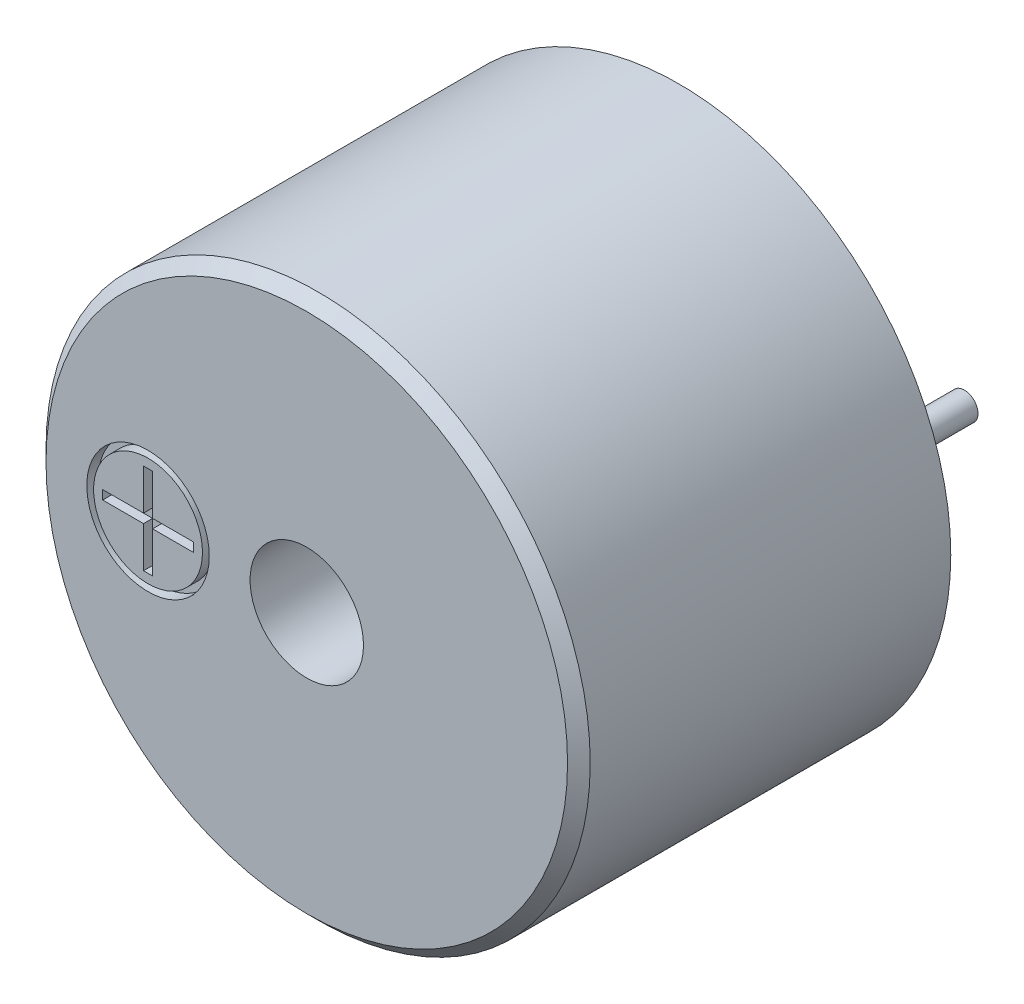
ISO-10303-21;
HEADER;
FILE_DESCRIPTION(('STEP AP214'),'2;1');
FILE_NAME('part.step','',(''),(''),'','','');
FILE_SCHEMA(('AUTOMOTIVE_DESIGN { 1 0 10303 214 1 1 1 1 }'));
ENDSEC;
DATA;
#1=APPLICATION_CONTEXT('core data for automotive mechanical design processes');
#2=APPLICATION_PROTOCOL_DEFINITION('international standard','automotive_design',2000,#1);
#3=PRODUCT_CONTEXT('',#1,'mechanical');
#4=PRODUCT('Part','Part','',(#3));
#5=PRODUCT_RELATED_PRODUCT_CATEGORY('part','',(#4));
#6=PRODUCT_DEFINITION_FORMATION('','',#4);
#7=PRODUCT_DEFINITION_CONTEXT('part definition',#1,'design');
#8=PRODUCT_DEFINITION('design','',#6,#7);
#9=PRODUCT_DEFINITION_SHAPE('','',#8);
#10=(LENGTH_UNIT() NAMED_UNIT(*) SI_UNIT(.MILLI.,.METRE.));
#11=(NAMED_UNIT(*) PLANE_ANGLE_UNIT() SI_UNIT($,.RADIAN.));
#12=(NAMED_UNIT(*) SI_UNIT($,.STERADIAN.) SOLID_ANGLE_UNIT());
#13=UNCERTAINTY_MEASURE_WITH_UNIT(LENGTH_MEASURE(1.E-05),#10,'distance_accuracy_value','');
#14=(GEOMETRIC_REPRESENTATION_CONTEXT(3) GLOBAL_UNCERTAINTY_ASSIGNED_CONTEXT((#13)) GLOBAL_UNIT_ASSIGNED_CONTEXT((#10,
#11,#12)) REPRESENTATION_CONTEXT('',''));
#15=CARTESIAN_POINT('',(0.,0.,0.));
#16=DIRECTION('',(0.,0.,1.));
#17=DIRECTION('',(1.,0.,0.));
#18=AXIS2_PLACEMENT_3D('',#15,#16,#17);
#19=CARTESIAN_POINT('',(-1.2,-0.1,8.));
#20=DIRECTION('',(0.,0.,1.));
#21=DIRECTION('',(1.,0.,0.));
#22=AXIS2_PLACEMENT_3D('',#19,#20,#21);
#23=PLANE('',#22);
#24=DIRECTION('',(1.,0.,0.));
#25=VECTOR('',#24,1.);
#26=CARTESIAN_POINT('',(-1.2,0.1,8.));
#27=LINE('',#26,#25);
#28=CARTESIAN_POINT('',(-0.3,0.1,8.));
#29=VERTEX_POINT('',#28);
#30=CARTESIAN_POINT('',(-0.1,0.1,8.));
#31=VERTEX_POINT('',#30);
#32=EDGE_CURVE('E11',#29,#31,#27,.T.);
#33=ORIENTED_EDGE('',*,*,#32,.F.);
#34=DIRECTION('',(0.,1.,0.));
#35=VECTOR('',#34,1.);
#36=CARTESIAN_POINT('',(-0.3,-1.,8.));
#37=LINE('',#36,#35);
#38=CARTESIAN_POINT('',(-0.3,-0.1,8.));
#39=VERTEX_POINT('',#38);
#40=EDGE_CURVE('E268',#39,#29,#37,.T.);
#41=ORIENTED_EDGE('',*,*,#40,.F.);
#42=DIRECTION('',(1.,0.,0.));
#43=VECTOR('',#42,1.);
#44=CARTESIAN_POINT('',(-1.2,-0.1,8.));
#45=LINE('',#44,#43);
#46=CARTESIAN_POINT('',(-0.1,-0.1,8.));
#47=VERTEX_POINT('',#46);
#48=EDGE_CURVE('E271',#39,#47,#45,.T.);
#49=ORIENTED_EDGE('',*,*,#48,.T.);
#50=DIRECTION('',(0.,1.,0.));
#51=VECTOR('',#50,1.);
#52=CARTESIAN_POINT('',(-0.1,-1.,8.));
#53=LINE('',#52,#51);
#54=EDGE_CURVE('E27',#47,#31,#53,.T.);
#55=ORIENTED_EDGE('',*,*,#54,.T.);
#56=EDGE_LOOP('',(#33,#41,#49,#55));
#57=FACE_BOUND('',#56,.T.);
#58=ADVANCED_FACE('F16',(#57),#23,.T.);
#59=CARTESIAN_POINT('',(-0.1,-1.,8.));
#60=DIRECTION('',(0.,0.,1.));
#61=DIRECTION('',(1.,0.,0.));
#62=AXIS2_PLACEMENT_3D('',#59,#60,#61);
#63=PLANE('',#62);
#64=DIRECTION('',(0.,1.,0.));
#65=VECTOR('',#64,1.);
#66=CARTESIAN_POINT('',(-0.3,-1.,8.));
#67=LINE('',#66,#65);
#68=CARTESIAN_POINT('',(-0.3,1.,8.));
#69=VERTEX_POINT('',#68);
#70=EDGE_CURVE('E344',#29,#69,#67,.T.);
#71=ORIENTED_EDGE('',*,*,#70,.F.);
#72=ORIENTED_EDGE('',*,*,#32,.T.);
#73=DIRECTION('',(0.,1.,0.));
#74=VECTOR('',#73,1.);
#75=CARTESIAN_POINT('',(-0.1,-1.,8.));
#76=LINE('',#75,#74);
#77=CARTESIAN_POINT('',(-0.1,1.,8.));
#78=VERTEX_POINT('',#77);
#79=EDGE_CURVE('E213',#31,#78,#76,.T.);
#80=ORIENTED_EDGE('',*,*,#79,.T.);
#81=DIRECTION('',(-1.,0.,0.));
#82=VECTOR('',#81,1.);
#83=CARTESIAN_POINT('',(-0.1,1.,8.));
#84=LINE('',#83,#82);
#85=EDGE_CURVE('E257',#78,#69,#84,.T.);
#86=ORIENTED_EDGE('',*,*,#85,.T.);
#87=EDGE_LOOP('',(#71,#72,#80,#86));
#88=FACE_BOUND('',#87,.T.);
#89=ADVANCED_FACE('F406',(#88),#63,.T.);
#90=CARTESIAN_POINT('',(-1.2,-0.1,8.));
#91=DIRECTION('',(0.,0.,1.));
#92=DIRECTION('',(1.,0.,0.));
#93=AXIS2_PLACEMENT_3D('',#90,#91,#92);
#94=PLANE('',#93);
#95=DIRECTION('',(1.,0.,0.));
#96=VECTOR('',#95,1.);
#97=CARTESIAN_POINT('',(-1.2,0.1,8.));
#98=LINE('',#97,#96);
#99=CARTESIAN_POINT('',(0.8,0.1,8.));
#100=VERTEX_POINT('',#99);
#101=EDGE_CURVE('E210',#31,#100,#98,.T.);
#102=ORIENTED_EDGE('',*,*,#101,.F.);
#103=ORIENTED_EDGE('',*,*,#54,.F.);
#104=DIRECTION('',(1.,0.,0.));
#105=VECTOR('',#104,1.);
#106=CARTESIAN_POINT('',(-1.2,-0.1,8.));
#107=LINE('',#106,#105);
#108=CARTESIAN_POINT('',(0.8,-0.1,8.));
#109=VERTEX_POINT('',#108);
#110=EDGE_CURVE('E337',#47,#109,#107,.T.);
#111=ORIENTED_EDGE('',*,*,#110,.T.);
#112=DIRECTION('',(0.,1.,0.));
#113=VECTOR('',#112,1.);
#114=CARTESIAN_POINT('',(0.8,-0.1,8.));
#115=LINE('',#114,#113);
#116=EDGE_CURVE('E263',#109,#100,#115,.T.);
#117=ORIENTED_EDGE('',*,*,#116,.T.);
#118=EDGE_LOOP('',(#102,#103,#111,#117));
#119=FACE_BOUND('',#118,.T.);
#120=ADVANCED_FACE('F675',(#119),#94,.T.);
#121=CARTESIAN_POINT('',(-0.1,-1.,8.));
#122=DIRECTION('',(0.,0.,1.));
#123=DIRECTION('',(1.,0.,0.));
#124=AXIS2_PLACEMENT_3D('',#121,#122,#123);
#125=PLANE('',#124);
#126=DIRECTION('',(0.,1.,0.));
#127=VECTOR('',#126,1.);
#128=CARTESIAN_POINT('',(-0.3,-1.,8.));
#129=LINE('',#128,#127);
#130=CARTESIAN_POINT('',(-0.3,-1.,8.));
#131=VERTEX_POINT('',#130);
#132=EDGE_CURVE('E227',#131,#39,#129,.T.);
#133=ORIENTED_EDGE('',*,*,#132,.F.);
#134=DIRECTION('',(-1.,0.,0.));
#135=VECTOR('',#134,1.);
#136=CARTESIAN_POINT('',(-0.1,-1.,8.));
#137=LINE('',#136,#135);
#138=CARTESIAN_POINT('',(-0.1,-1.,8.));
#139=VERTEX_POINT('',#138);
#140=EDGE_CURVE('E349',#139,#131,#137,.T.);
#141=ORIENTED_EDGE('',*,*,#140,.F.);
#142=DIRECTION('',(0.,1.,0.));
#143=VECTOR('',#142,1.);
#144=CARTESIAN_POINT('',(-0.1,-1.,8.));
#145=LINE('',#144,#143);
#146=EDGE_CURVE('E20',#139,#47,#145,.T.);
#147=ORIENTED_EDGE('',*,*,#146,.T.);
#148=ORIENTED_EDGE('',*,*,#48,.F.);
#149=EDGE_LOOP('',(#133,#141,#147,#148));
#150=FACE_BOUND('',#149,.T.);
#151=ADVANCED_FACE('F448',(#150),#125,.T.);
#152=CARTESIAN_POINT('',(-1.2,-0.1,8.));
#153=DIRECTION('',(0.,0.,1.));
#154=DIRECTION('',(1.,0.,0.));
#155=AXIS2_PLACEMENT_3D('',#152,#153,#154);
#156=PLANE('',#155);
#157=DIRECTION('',(1.,0.,0.));
#158=VECTOR('',#157,1.);
#159=CARTESIAN_POINT('',(-1.2,0.1,8.));
#160=LINE('',#159,#158);
#161=CARTESIAN_POINT('',(-1.2,0.1,8.));
#162=VERTEX_POINT('',#161);
#163=EDGE_CURVE('E272',#162,#29,#160,.T.);
#164=ORIENTED_EDGE('',*,*,#163,.F.);
#165=DIRECTION('',(0.,1.,0.));
#166=VECTOR('',#165,1.);
#167=CARTESIAN_POINT('',(-1.2,-0.1,8.));
#168=LINE('',#167,#166);
#169=CARTESIAN_POINT('',(-1.2,-0.1,8.));
#170=VERTEX_POINT('',#169);
#171=EDGE_CURVE('E251',#170,#162,#168,.T.);
#172=ORIENTED_EDGE('',*,*,#171,.F.);
#173=DIRECTION('',(1.,0.,0.));
#174=VECTOR('',#173,1.);
#175=CARTESIAN_POINT('',(-1.2,-0.1,8.));
#176=LINE('',#175,#174);
#177=EDGE_CURVE('E285',#170,#39,#176,.T.);
#178=ORIENTED_EDGE('',*,*,#177,.T.);
#179=ORIENTED_EDGE('',*,*,#40,.T.);
#180=EDGE_LOOP('',(#164,#172,#178,#179));
#181=FACE_BOUND('',#180,.T.);
#182=ADVANCED_FACE('F425',(#181),#156,.T.);
#183=CARTESIAN_POINT('',(-1.2,0.1,8.));
#184=DIRECTION('',(0.,1.,0.));
#185=DIRECTION('',(1.,0.,0.));
#186=AXIS2_PLACEMENT_3D('',#183,#184,#185);
#187=PLANE('',#186);
#188=DIRECTION('',(0.,0.,1.));
#189=VECTOR('',#188,1.);
#190=CARTESIAN_POINT('',(-0.3,0.1,8.));
#191=LINE('',#190,#189);
#192=CARTESIAN_POINT('',(-0.3,0.1,8.2));
#193=VERTEX_POINT('',#192);
#194=EDGE_CURVE('E261',#29,#193,#191,.T.);
#195=ORIENTED_EDGE('',*,*,#194,.T.);
#196=DIRECTION('',(1.,0.,0.));
#197=VECTOR('',#196,1.);
#198=CARTESIAN_POINT('',(-1.2,0.1,8.2));
#199=LINE('',#198,#197);
#200=CARTESIAN_POINT('',(-1.2,0.1,8.2));
#201=VERTEX_POINT('',#200);
#202=EDGE_CURVE('E312',#201,#193,#199,.T.);
#203=ORIENTED_EDGE('',*,*,#202,.F.);
#204=DIRECTION('',(0.,0.,1.));
#205=VECTOR('',#204,1.);
#206=CARTESIAN_POINT('',(-1.2,0.1,8.));
#207=LINE('',#206,#205);
#208=EDGE_CURVE('E255',#162,#201,#207,.T.);
#209=ORIENTED_EDGE('',*,*,#208,.F.);
#210=ORIENTED_EDGE('',*,*,#163,.T.);
#211=EDGE_LOOP('',(#195,#203,#209,#210));
#212=FACE_BOUND('',#211,.T.);
#213=ADVANCED_FACE('F421',(#212),#187,.F.);
#214=CARTESIAN_POINT('',(-0.3,-1.,8.));
#215=DIRECTION('',(-1.,0.,0.));
#216=DIRECTION('',(0.,1.,0.));
#217=AXIS2_PLACEMENT_3D('',#214,#215,#216);
#218=PLANE('',#217);
#219=DIRECTION('',(0.,0.,1.));
#220=VECTOR('',#219,1.);
#221=CARTESIAN_POINT('',(-0.3,1.,8.));
#222=LINE('',#221,#220);
#223=CARTESIAN_POINT('',(-0.3,1.,8.2));
#224=VERTEX_POINT('',#223);
#225=EDGE_CURVE('E262',#69,#224,#222,.T.);
#226=ORIENTED_EDGE('',*,*,#225,.T.);
#227=DIRECTION('',(0.,1.,0.));
#228=VECTOR('',#227,1.);
#229=CARTESIAN_POINT('',(-0.3,-1.,8.2));
#230=LINE('',#229,#228);
#231=EDGE_CURVE('E325',#193,#224,#230,.T.);
#232=ORIENTED_EDGE('',*,*,#231,.F.);
#233=ORIENTED_EDGE('',*,*,#194,.F.);
#234=ORIENTED_EDGE('',*,*,#70,.T.);
#235=EDGE_LOOP('',(#226,#232,#233,#234));
#236=FACE_BOUND('',#235,.T.);
#237=ADVANCED_FACE('F402',(#236),#218,.F.);
#238=CARTESIAN_POINT('',(-0.1,1.,8.));
#239=DIRECTION('',(0.,1.,0.));
#240=DIRECTION('',(1.,0.,0.));
#241=AXIS2_PLACEMENT_3D('',#238,#239,#240);
#242=PLANE('',#241);
#243=DIRECTION('',(-1.,0.,0.));
#244=VECTOR('',#243,1.);
#245=CARTESIAN_POINT('',(-0.1,1.,8.2));
#246=LINE('',#245,#244);
#247=CARTESIAN_POINT('',(-0.1,1.,8.2));
#248=VERTEX_POINT('',#247);
#249=EDGE_CURVE('E299',#248,#224,#246,.T.);
#250=ORIENTED_EDGE('',*,*,#249,.T.);
#251=ORIENTED_EDGE('',*,*,#225,.F.);
#252=ORIENTED_EDGE('',*,*,#85,.F.);
#253=DIRECTION('',(0.,0.,1.));
#254=VECTOR('',#253,1.);
#255=CARTESIAN_POINT('',(-0.1,1.,8.));
#256=LINE('',#255,#254);
#257=EDGE_CURVE('E279',#78,#248,#256,.T.);
#258=ORIENTED_EDGE('',*,*,#257,.T.);
#259=EDGE_LOOP('',(#250,#251,#252,#258));
#260=FACE_BOUND('',#259,.T.);
#261=ADVANCED_FACE('F410',(#260),#242,.F.);
#262=CARTESIAN_POINT('',(-0.1,-1.,8.));
#263=DIRECTION('',(-1.,0.,0.));
#264=DIRECTION('',(0.,1.,0.));
#265=AXIS2_PLACEMENT_3D('',#262,#263,#264);
#266=PLANE('',#265);
#267=ORIENTED_EDGE('',*,*,#79,.F.);
#268=DIRECTION('',(0.,0.,1.));
#269=VECTOR('',#268,1.);
#270=CARTESIAN_POINT('',(-0.1,0.1,8.));
#271=LINE('',#270,#269);
#272=CARTESIAN_POINT('',(-0.1,0.1,8.2));
#273=VERTEX_POINT('',#272);
#274=EDGE_CURVE('E214',#31,#273,#271,.T.);
#275=ORIENTED_EDGE('',*,*,#274,.T.);
#276=DIRECTION('',(0.,1.,0.));
#277=VECTOR('',#276,1.);
#278=CARTESIAN_POINT('',(-0.1,-1.,8.2));
#279=LINE('',#278,#277);
#280=EDGE_CURVE('E243',#273,#248,#279,.T.);
#281=ORIENTED_EDGE('',*,*,#280,.T.);
#282=ORIENTED_EDGE('',*,*,#257,.F.);
#283=EDGE_LOOP('',(#267,#275,#281,#282));
#284=FACE_BOUND('',#283,.T.);
#285=ADVANCED_FACE('F643',(#284),#266,.T.);
#286=CARTESIAN_POINT('',(-1.2,0.1,8.));
#287=DIRECTION('',(0.,1.,0.));
#288=DIRECTION('',(1.,0.,0.));
#289=AXIS2_PLACEMENT_3D('',#286,#287,#288);
#290=PLANE('',#289);
#291=DIRECTION('',(0.,0.,1.));
#292=VECTOR('',#291,1.);
#293=CARTESIAN_POINT('',(0.8,0.1,8.));
#294=LINE('',#293,#292);
#295=CARTESIAN_POINT('',(0.8,0.1,8.2));
#296=VERTEX_POINT('',#295);
#297=EDGE_CURVE('E267',#100,#296,#294,.T.);
#298=ORIENTED_EDGE('',*,*,#297,.T.);
#299=DIRECTION('',(1.,0.,0.));
#300=VECTOR('',#299,1.);
#301=CARTESIAN_POINT('',(-1.2,0.1,8.2));
#302=LINE('',#301,#300);
#303=EDGE_CURVE('E238',#273,#296,#302,.T.);
#304=ORIENTED_EDGE('',*,*,#303,.F.);
#305=ORIENTED_EDGE('',*,*,#274,.F.);
#306=ORIENTED_EDGE('',*,*,#101,.T.);
#307=EDGE_LOOP('',(#298,#304,#305,#306));
#308=FACE_BOUND('',#307,.T.);
#309=ADVANCED_FACE('F647',(#308),#290,.F.);
#310=CARTESIAN_POINT('',(0.8,-0.1,8.));
#311=DIRECTION('',(1.,0.,0.));
#312=DIRECTION('',(0.,1.,0.));
#313=AXIS2_PLACEMENT_3D('',#310,#311,#312);
#314=PLANE('',#313);
#315=DIRECTION('',(0.,1.,0.));
#316=VECTOR('',#315,1.);
#317=CARTESIAN_POINT('',(0.8,-0.1,8.2));
#318=LINE('',#317,#316);
#319=CARTESIAN_POINT('',(0.8,-0.1,8.2));
#320=VERTEX_POINT('',#319);
#321=EDGE_CURVE('E242',#320,#296,#318,.T.);
#322=ORIENTED_EDGE('',*,*,#321,.T.);
#323=ORIENTED_EDGE('',*,*,#297,.F.);
#324=ORIENTED_EDGE('',*,*,#116,.F.);
#325=DIRECTION('',(0.,0.,1.));
#326=VECTOR('',#325,1.);
#327=CARTESIAN_POINT('',(0.8,-0.1,8.));
#328=LINE('',#327,#326);
#329=EDGE_CURVE('E335',#109,#320,#328,.T.);
#330=ORIENTED_EDGE('',*,*,#329,.T.);
#331=EDGE_LOOP('',(#322,#323,#324,#330));
#332=FACE_BOUND('',#331,.T.);
#333=ADVANCED_FACE('F805',(#332),#314,.F.);
#334=CARTESIAN_POINT('',(-1.2,-0.1,8.));
#335=DIRECTION('',(0.,1.,0.));
#336=DIRECTION('',(1.,0.,0.));
#337=AXIS2_PLACEMENT_3D('',#334,#335,#336);
#338=PLANE('',#337);
#339=ORIENTED_EDGE('',*,*,#110,.F.);
#340=DIRECTION('',(0.,0.,1.));
#341=VECTOR('',#340,1.);
#342=CARTESIAN_POINT('',(-0.1,-0.1,8.));
#343=LINE('',#342,#341);
#344=CARTESIAN_POINT('',(-0.1,-0.1,8.2));
#345=VERTEX_POINT('',#344);
#346=EDGE_CURVE('E394',#47,#345,#343,.T.);
#347=ORIENTED_EDGE('',*,*,#346,.T.);
#348=DIRECTION('',(1.,0.,0.));
#349=VECTOR('',#348,1.);
#350=CARTESIAN_POINT('',(-1.2,-0.1,8.2));
#351=LINE('',#350,#349);
#352=EDGE_CURVE('E292',#345,#320,#351,.T.);
#353=ORIENTED_EDGE('',*,*,#352,.T.);
#354=ORIENTED_EDGE('',*,*,#329,.F.);
#355=EDGE_LOOP('',(#339,#347,#353,#354));
#356=FACE_BOUND('',#355,.T.);
#357=ADVANCED_FACE('F657',(#356),#338,.T.);
#358=CARTESIAN_POINT('',(-0.1,-1.,8.));
#359=DIRECTION('',(-1.,0.,0.));
#360=DIRECTION('',(0.,1.,0.));
#361=AXIS2_PLACEMENT_3D('',#358,#359,#360);
#362=PLANE('',#361);
#363=ORIENTED_EDGE('',*,*,#146,.F.);
#364=DIRECTION('',(0.,0.,1.));
#365=VECTOR('',#364,1.);
#366=CARTESIAN_POINT('',(-0.1,-1.,8.));
#367=LINE('',#366,#365);
#368=CARTESIAN_POINT('',(-0.1,-1.,8.2));
#369=VERTEX_POINT('',#368);
#370=EDGE_CURVE('E324',#139,#369,#367,.T.);
#371=ORIENTED_EDGE('',*,*,#370,.T.);
#372=DIRECTION('',(0.,1.,0.));
#373=VECTOR('',#372,1.);
#374=CARTESIAN_POINT('',(-0.1,-1.,8.2));
#375=LINE('',#374,#373);
#376=EDGE_CURVE('E234',#369,#345,#375,.T.);
#377=ORIENTED_EDGE('',*,*,#376,.T.);
#378=ORIENTED_EDGE('',*,*,#346,.F.);
#379=EDGE_LOOP('',(#363,#371,#377,#378));
#380=FACE_BOUND('',#379,.T.);
#381=ADVANCED_FACE('F653',(#380),#362,.T.);
#382=CARTESIAN_POINT('',(-0.1,-1.,8.));
#383=DIRECTION('',(0.,1.,0.));
#384=DIRECTION('',(1.,0.,0.));
#385=AXIS2_PLACEMENT_3D('',#382,#383,#384);
#386=PLANE('',#385);
#387=ORIENTED_EDGE('',*,*,#370,.F.);
#388=ORIENTED_EDGE('',*,*,#140,.T.);
#389=DIRECTION('',(0.,0.,1.));
#390=VECTOR('',#389,1.);
#391=CARTESIAN_POINT('',(-0.3,-1.,8.));
#392=LINE('',#391,#390);
#393=CARTESIAN_POINT('',(-0.3,-1.,8.2));
#394=VERTEX_POINT('',#393);
#395=EDGE_CURVE('E224',#131,#394,#392,.T.);
#396=ORIENTED_EDGE('',*,*,#395,.T.);
#397=DIRECTION('',(-1.,0.,0.));
#398=VECTOR('',#397,1.);
#399=CARTESIAN_POINT('',(-0.1,-1.,8.2));
#400=LINE('',#399,#398);
#401=EDGE_CURVE('E229',#369,#394,#400,.T.);
#402=ORIENTED_EDGE('',*,*,#401,.F.);
#403=EDGE_LOOP('',(#387,#388,#396,#402));
#404=FACE_BOUND('',#403,.T.);
#405=ADVANCED_FACE('F446',(#404),#386,.T.);
#406=CARTESIAN_POINT('',(-0.3,-1.,8.));
#407=DIRECTION('',(-1.,0.,0.));
#408=DIRECTION('',(0.,1.,0.));
#409=AXIS2_PLACEMENT_3D('',#406,#407,#408);
#410=PLANE('',#409);
#411=DIRECTION('',(0.,0.,1.));
#412=VECTOR('',#411,1.);
#413=CARTESIAN_POINT('',(-0.3,-0.1,8.));
#414=LINE('',#413,#412);
#415=CARTESIAN_POINT('',(-0.3,-0.1,8.2));
#416=VERTEX_POINT('',#415);
#417=EDGE_CURVE('E228',#39,#416,#414,.T.);
#418=ORIENTED_EDGE('',*,*,#417,.T.);
#419=DIRECTION('',(0.,1.,0.));
#420=VECTOR('',#419,1.);
#421=CARTESIAN_POINT('',(-0.3,-1.,8.2));
#422=LINE('',#421,#420);
#423=EDGE_CURVE('E233',#394,#416,#422,.T.);
#424=ORIENTED_EDGE('',*,*,#423,.F.);
#425=ORIENTED_EDGE('',*,*,#395,.F.);
#426=ORIENTED_EDGE('',*,*,#132,.T.);
#427=EDGE_LOOP('',(#418,#424,#425,#426));
#428=FACE_BOUND('',#427,.T.);
#429=ADVANCED_FACE('F435',(#428),#410,.F.);
#430=CARTESIAN_POINT('',(-1.2,-0.1,8.));
#431=DIRECTION('',(0.,1.,0.));
#432=DIRECTION('',(1.,0.,0.));
#433=AXIS2_PLACEMENT_3D('',#430,#431,#432);
#434=PLANE('',#433);
#435=ORIENTED_EDGE('',*,*,#177,.F.);
#436=DIRECTION('',(0.,0.,1.));
#437=VECTOR('',#436,1.);
#438=CARTESIAN_POINT('',(-1.2,-0.1,8.));
#439=LINE('',#438,#437);
#440=CARTESIAN_POINT('',(-1.2,-0.1,8.2));
#441=VERTEX_POINT('',#440);
#442=EDGE_CURVE('E256',#170,#441,#439,.T.);
#443=ORIENTED_EDGE('',*,*,#442,.T.);
#444=DIRECTION('',(1.,0.,0.));
#445=VECTOR('',#444,1.);
#446=CARTESIAN_POINT('',(-1.2,-0.1,8.2));
#447=LINE('',#446,#445);
#448=EDGE_CURVE('E313',#441,#416,#447,.T.);
#449=ORIENTED_EDGE('',*,*,#448,.T.);
#450=ORIENTED_EDGE('',*,*,#417,.F.);
#451=EDGE_LOOP('',(#435,#443,#449,#450));
#452=FACE_BOUND('',#451,.T.);
#453=ADVANCED_FACE('F440',(#452),#434,.T.);
#454=CARTESIAN_POINT('',(-1.2,-0.1,8.));
#455=DIRECTION('',(1.,0.,0.));
#456=DIRECTION('',(0.,1.,0.));
#457=AXIS2_PLACEMENT_3D('',#454,#455,#456);
#458=PLANE('',#457);
#459=ORIENTED_EDGE('',*,*,#442,.F.);
#460=ORIENTED_EDGE('',*,*,#171,.T.);
#461=ORIENTED_EDGE('',*,*,#208,.T.);
#462=DIRECTION('',(0.,1.,0.));
#463=VECTOR('',#462,1.);
#464=CARTESIAN_POINT('',(-1.2,-0.1,8.2));
#465=LINE('',#464,#463);
#466=EDGE_CURVE('E218',#441,#201,#465,.T.);
#467=ORIENTED_EDGE('',*,*,#466,.F.);
#468=EDGE_LOOP('',(#459,#460,#461,#467));
#469=FACE_BOUND('',#468,.T.);
#470=ADVANCED_FACE('F680',(#469),#458,.T.);
#471=CARTESIAN_POINT('',(3.3,0.,8.2));
#472=DIRECTION('',(0.,0.,1.));
#473=DIRECTION('',(1.,0.,0.));
#474=AXIS2_PLACEMENT_3D('',#471,#472,#473);
#475=PLANE('',#474);
#476=ORIENTED_EDGE('',*,*,#466,.T.);
#477=ORIENTED_EDGE('',*,*,#202,.T.);
#478=ORIENTED_EDGE('',*,*,#231,.T.);
#479=ORIENTED_EDGE('',*,*,#249,.F.);
#480=ORIENTED_EDGE('',*,*,#280,.F.);
#481=ORIENTED_EDGE('',*,*,#303,.T.);
#482=ORIENTED_EDGE('',*,*,#321,.F.);
#483=ORIENTED_EDGE('',*,*,#352,.F.);
#484=ORIENTED_EDGE('',*,*,#376,.F.);
#485=ORIENTED_EDGE('',*,*,#401,.T.);
#486=ORIENTED_EDGE('',*,*,#423,.T.);
#487=ORIENTED_EDGE('',*,*,#448,.F.);
#488=EDGE_LOOP('',(#476,#477,#478,#479,#480,#481,#482,#483,#484,#485,#486,#487));
#489=FACE_BOUND('',#488,.T.);
#490=CARTESIAN_POINT('',(-0.2,0.,8.2));
#491=DIRECTION('',(0.,0.,1.));
#492=DIRECTION('',(1.,0.,0.));
#493=AXIS2_PLACEMENT_3D('',#490,#491,#492);
#494=CIRCLE('',#493,1.2);
#495=CARTESIAN_POINT('',(1.,0.,8.2));
#496=VERTEX_POINT('',#495);
#497=EDGE_CURVE('E219',#496,#496,#494,.T.);
#498=ORIENTED_EDGE('',*,*,#497,.T.);
#499=EDGE_LOOP('',(#498));
#500=FACE_BOUND('',#499,.T.);
#501=ADVANCED_FACE('F414',(#489,#500),#475,.T.);
#502=CARTESIAN_POINT('',(-0.2,0.,7.95));
#503=DIRECTION('',(0.,0.,1.));
#504=DIRECTION('',(1.,0.,0.));
#505=AXIS2_PLACEMENT_3D('',#502,#503,#504);
#506=CYLINDRICAL_SURFACE('',#505,1.2);
#507=ORIENTED_EDGE('',*,*,#497,.F.);
#508=DIRECTION('',(0.,0.,1.));
#509=VECTOR('',#508,1.);
#510=CARTESIAN_POINT('',(1.,0.,7.95));
#511=LINE('',#510,#509);
#512=CARTESIAN_POINT('',(1.,0.,7.95));
#513=VERTEX_POINT('',#512);
#514=EDGE_CURVE('E215',#513,#496,#511,.T.);
#515=ORIENTED_EDGE('',*,*,#514,.F.);
#516=CARTESIAN_POINT('',(-0.2,0.,7.95));
#517=DIRECTION('',(0.,0.,1.));
#518=DIRECTION('',(1.,0.,0.));
#519=AXIS2_PLACEMENT_3D('',#516,#517,#518);
#520=CIRCLE('',#519,1.2);
#521=EDGE_CURVE('E205',#513,#513,#520,.T.);
#522=ORIENTED_EDGE('',*,*,#521,.T.);
#523=ORIENTED_EDGE('',*,*,#514,.T.);
#524=EDGE_LOOP('',(#507,#515,#522,#523));
#525=FACE_BOUND('',#524,.T.);
#526=ADVANCED_FACE('F694',(#525),#506,.T.);
#527=CARTESIAN_POINT('',(3.3,0.,5.7));
#528=DIRECTION('',(0.,0.,1.));
#529=DIRECTION('',(1.,0.,0.));
#530=AXIS2_PLACEMENT_3D('',#527,#528,#529);
#531=PLANE('',#530);
#532=CARTESIAN_POINT('',(3.3,0.,5.7));
#533=DIRECTION('',(0.,0.,1.));
#534=DIRECTION('',(1.,0.,0.));
#535=AXIS2_PLACEMENT_3D('',#532,#533,#534);
#536=CIRCLE('',#535,1.25);
#537=CARTESIAN_POINT('',(4.55,0.,5.7));
#538=VERTEX_POINT('',#537);
#539=EDGE_CURVE('E196',#538,#538,#536,.T.);
#540=ORIENTED_EDGE('',*,*,#539,.T.);
#541=EDGE_LOOP('',(#540));
#542=FACE_BOUND('',#541,.T.);
#543=ADVANCED_FACE('F689',(#542),#531,.T.);
#544=CARTESIAN_POINT('',(-0.2,0.,7.95));
#545=DIRECTION('',(0.,0.,1.));
#546=DIRECTION('',(1.,0.,0.));
#547=AXIS2_PLACEMENT_3D('',#544,#545,#546);
#548=PLANE('',#547);
#549=ORIENTED_EDGE('',*,*,#521,.F.);
#550=EDGE_LOOP('',(#549));
#551=FACE_BOUND('',#550,.T.);
#552=CARTESIAN_POINT('',(-0.2,0.,7.95));
#553=DIRECTION('',(0.,0.,1.));
#554=DIRECTION('',(1.,0.,0.));
#555=AXIS2_PLACEMENT_3D('',#552,#553,#554);
#556=CIRCLE('',#555,1.35);
#557=CARTESIAN_POINT('',(1.15,0.,7.95));
#558=VERTEX_POINT('',#557);
#559=EDGE_CURVE('E198',#558,#558,#556,.T.);
#560=ORIENTED_EDGE('',*,*,#559,.T.);
#561=EDGE_LOOP('',(#560));
#562=FACE_BOUND('',#561,.T.);
#563=ADVANCED_FACE('F693',(#551,#562),#548,.T.);
#564=CARTESIAN_POINT('',(6.6,0.,-3.));
#565=DIRECTION('',(0.,0.,1.));
#566=DIRECTION('',(1.,0.,0.));
#567=AXIS2_PLACEMENT_3D('',#564,#565,#566);
#568=PLANE('',#567);
#569=CARTESIAN_POINT('',(6.6,0.,-3.));
#570=DIRECTION('',(0.,0.,1.));
#571=DIRECTION('',(1.,0.,0.));
#572=AXIS2_PLACEMENT_3D('',#569,#570,#571);
#573=CIRCLE('',#572,0.3);
#574=CARTESIAN_POINT('',(6.9,0.,-3.));
#575=VERTEX_POINT('',#574);
#576=EDGE_CURVE('E246',#575,#575,#573,.T.);
#577=ORIENTED_EDGE('',*,*,#576,.F.);
#578=EDGE_LOOP('',(#577));
#579=FACE_BOUND('',#578,.T.);
#580=ADVANCED_FACE('F638',(#579),#568,.F.);
#581=CARTESIAN_POINT('',(0.,0.,-3.));
#582=DIRECTION('',(0.,0.,1.));
#583=DIRECTION('',(1.,0.,0.));
#584=AXIS2_PLACEMENT_3D('',#581,#582,#583);
#585=PLANE('',#584);
#586=CARTESIAN_POINT('',(0.,0.,-3.));
#587=DIRECTION('',(0.,0.,1.));
#588=DIRECTION('',(1.,0.,0.));
#589=AXIS2_PLACEMENT_3D('',#586,#587,#588);
#590=CIRCLE('',#589,0.3);
#591=CARTESIAN_POINT('',(0.3,0.,-3.));
#592=VERTEX_POINT('',#591);
#593=EDGE_CURVE('E247',#592,#592,#590,.T.);
#594=ORIENTED_EDGE('',*,*,#593,.F.);
#595=EDGE_LOOP('',(#594));
#596=FACE_BOUND('',#595,.T.);
#597=ADVANCED_FACE('F634',(#596),#585,.F.);
#598=CARTESIAN_POINT('',(3.3,0.,5.7));
#599=DIRECTION('',(0.,0.,-1.));
#600=DIRECTION('',(1.,0.,0.));
#601=AXIS2_PLACEMENT_3D('',#598,#599,#600);
#602=CYLINDRICAL_SURFACE('',#601,1.25);
#603=DIRECTION('',(0.,0.,1.));
#604=VECTOR('',#603,1.);
#605=CARTESIAN_POINT('',(4.55,0.,5.7));
#606=LINE('',#605,#604);
#607=CARTESIAN_POINT('',(4.55,0.,8.2));
#608=VERTEX_POINT('',#607);
#609=EDGE_CURVE('E192',#538,#608,#606,.T.);
#610=ORIENTED_EDGE('',*,*,#609,.T.);
#611=CARTESIAN_POINT('',(3.3,0.,8.2));
#612=DIRECTION('',(0.,0.,1.));
#613=DIRECTION('',(1.,0.,0.));
#614=AXIS2_PLACEMENT_3D('',#611,#612,#613);
#615=CIRCLE('',#614,1.25);
#616=EDGE_CURVE('E195',#608,#608,#615,.T.);
#617=ORIENTED_EDGE('',*,*,#616,.T.);
#618=ORIENTED_EDGE('',*,*,#609,.F.);
#619=ORIENTED_EDGE('',*,*,#539,.F.);
#620=EDGE_LOOP('',(#610,#617,#618,#619));
#621=FACE_BOUND('',#620,.T.);
#622=ADVANCED_FACE('F193',(#621),#602,.F.);
#623=CARTESIAN_POINT('',(-0.2,0.,7.95));
#624=DIRECTION('',(0.,0.,1.));
#625=DIRECTION('',(1.,0.,0.));
#626=AXIS2_PLACEMENT_3D('',#623,#624,#625);
#627=CYLINDRICAL_SURFACE('',#626,1.35);
#628=DIRECTION('',(0.,0.,1.));
#629=VECTOR('',#628,1.);
#630=CARTESIAN_POINT('',(1.15,0.,7.95));
#631=LINE('',#630,#629);
#632=CARTESIAN_POINT('',(1.15,0.,8.2));
#633=VERTEX_POINT('',#632);
#634=EDGE_CURVE('E207',#558,#633,#631,.T.);
#635=ORIENTED_EDGE('',*,*,#634,.F.);
#636=ORIENTED_EDGE('',*,*,#559,.F.);
#637=ORIENTED_EDGE('',*,*,#634,.T.);
#638=CARTESIAN_POINT('',(-0.2,0.,8.2));
#639=DIRECTION('',(0.,0.,1.));
#640=DIRECTION('',(1.,0.,0.));
#641=AXIS2_PLACEMENT_3D('',#638,#639,#640);
#642=CIRCLE('',#641,1.35);
#643=EDGE_CURVE('E282',#633,#633,#642,.T.);
#644=ORIENTED_EDGE('',*,*,#643,.T.);
#645=EDGE_LOOP('',(#635,#636,#637,#644));
#646=FACE_BOUND('',#645,.T.);
#647=ADVANCED_FACE('F703',(#646),#627,.F.);
#648=CARTESIAN_POINT('',(6.6,0.,-3.));
#649=DIRECTION('',(0.,0.,-1.));
#650=DIRECTION('',(1.,0.,0.));
#651=AXIS2_PLACEMENT_3D('',#648,#649,#650);
#652=CYLINDRICAL_SURFACE('',#651,0.3);
#653=ORIENTED_EDGE('',*,*,#576,.T.);
#654=DIRECTION('',(0.,0.,1.));
#655=VECTOR('',#654,1.);
#656=CARTESIAN_POINT('',(6.9,0.,-3.));
#657=LINE('',#656,#655);
#658=CARTESIAN_POINT('',(6.9,0.,0.));
#659=VERTEX_POINT('',#658);
#660=EDGE_CURVE('E237',#575,#659,#657,.T.);
#661=ORIENTED_EDGE('',*,*,#660,.T.);
#662=CARTESIAN_POINT('',(6.6,0.,0.));
#663=DIRECTION('',(0.,0.,1.));
#664=DIRECTION('',(1.,0.,0.));
#665=AXIS2_PLACEMENT_3D('',#662,#663,#664);
#666=CIRCLE('',#665,0.3);
#667=EDGE_CURVE('E295',#659,#659,#666,.T.);
#668=ORIENTED_EDGE('',*,*,#667,.F.);
#669=ORIENTED_EDGE('',*,*,#660,.F.);
#670=EDGE_LOOP('',(#653,#661,#668,#669));
#671=FACE_BOUND('',#670,.T.);
#672=ADVANCED_FACE('F737',(#671),#652,.T.);
#673=CARTESIAN_POINT('',(0.,0.,-3.));
#674=DIRECTION('',(0.,0.,-1.));
#675=DIRECTION('',(1.,0.,0.));
#676=AXIS2_PLACEMENT_3D('',#673,#674,#675);
#677=CYLINDRICAL_SURFACE('',#676,0.3);
#678=ORIENTED_EDGE('',*,*,#593,.T.);
#679=DIRECTION('',(0.,0.,1.));
#680=VECTOR('',#679,1.);
#681=CARTESIAN_POINT('',(0.3,0.,-3.));
#682=LINE('',#681,#680);
#683=CARTESIAN_POINT('',(0.3,0.,0.));
#684=VERTEX_POINT('',#683);
#685=EDGE_CURVE('E158',#592,#684,#682,.T.);
#686=ORIENTED_EDGE('',*,*,#685,.T.);
#687=CARTESIAN_POINT('',(0.,0.,0.));
#688=DIRECTION('',(0.,0.,1.));
#689=DIRECTION('',(1.,0.,0.));
#690=AXIS2_PLACEMENT_3D('',#687,#688,#689);
#691=CIRCLE('',#690,0.3);
#692=EDGE_CURVE('E222',#684,#684,#691,.T.);
#693=ORIENTED_EDGE('',*,*,#692,.F.);
#694=ORIENTED_EDGE('',*,*,#685,.F.);
#695=EDGE_LOOP('',(#678,#686,#693,#694));
#696=FACE_BOUND('',#695,.T.);
#697=ADVANCED_FACE('F666',(#696),#677,.T.);
#698=CARTESIAN_POINT('',(3.3,0.,8.2));
#699=DIRECTION('',(0.,0.,1.));
#700=DIRECTION('',(1.,0.,0.));
#701=AXIS2_PLACEMENT_3D('',#698,#699,#700);
#702=PLANE('',#701);
#703=ORIENTED_EDGE('',*,*,#616,.F.);
#704=EDGE_LOOP('',(#703));
#705=FACE_BOUND('',#704,.T.);
#706=ORIENTED_EDGE('',*,*,#643,.F.);
#707=EDGE_LOOP('',(#706));
#708=FACE_BOUND('',#707,.T.);
#709=CARTESIAN_POINT('',(3.3,0.,8.2));
#710=DIRECTION('',(0.,0.,1.));
#711=DIRECTION('',(1.,0.,0.));
#712=AXIS2_PLACEMENT_3D('',#709,#710,#711);
#713=CIRCLE('',#712,5.75);
#714=CARTESIAN_POINT('',(9.05,0.,8.2));
#715=VERTEX_POINT('',#714);
#716=EDGE_CURVE('E168',#715,#715,#713,.T.);
#717=ORIENTED_EDGE('',*,*,#716,.T.);
#718=EDGE_LOOP('',(#717));
#719=FACE_BOUND('',#718,.T.);
#720=ADVANCED_FACE('F662',(#705,#708,#719),#702,.T.);
#721=CARTESIAN_POINT('',(3.3,0.,0.));
#722=DIRECTION('',(0.,0.,1.));
#723=DIRECTION('',(1.,0.,0.));
#724=AXIS2_PLACEMENT_3D('',#721,#722,#723);
#725=PLANE('',#724);
#726=ORIENTED_EDGE('',*,*,#667,.T.);
#727=EDGE_LOOP('',(#726));
#728=FACE_BOUND('',#727,.T.);
#729=ORIENTED_EDGE('',*,*,#692,.T.);
#730=EDGE_LOOP('',(#729));
#731=FACE_BOUND('',#730,.T.);
#732=CARTESIAN_POINT('',(3.3,0.,0.));
#733=DIRECTION('',(0.,0.,1.));
#734=DIRECTION('',(1.,0.,0.));
#735=AXIS2_PLACEMENT_3D('',#732,#733,#734);
#736=CIRCLE('',#735,6.);
#737=CARTESIAN_POINT('',(9.3,0.,0.));
#738=VERTEX_POINT('',#737);
#739=EDGE_CURVE('E302',#738,#738,#736,.T.);
#740=ORIENTED_EDGE('',*,*,#739,.F.);
#741=EDGE_LOOP('',(#740));
#742=FACE_BOUND('',#741,.T.);
#743=ADVANCED_FACE('F629',(#728,#731,#742),#725,.F.);
#744=CARTESIAN_POINT('',(3.3,0.,7.95));
#745=DIRECTION('',(0.,0.,-1.));
#746=DIRECTION('',(1.,0.,0.));
#747=AXIS2_PLACEMENT_3D('',#744,#745,#746);
#748=CONICAL_SURFACE('',#747,6.,0.785398163397);
#749=DIRECTION('',(-0.707106781186548,0.,0.707106781186548));
#750=VECTOR('',#749,1.);
#751=CARTESIAN_POINT('',(9.3,0.,7.95));
#752=LINE('',#751,#750);
#753=CARTESIAN_POINT('',(9.3,0.,7.95));
#754=VERTEX_POINT('',#753);
#755=EDGE_CURVE('E223',#754,#715,#752,.T.);
#756=ORIENTED_EDGE('',*,*,#755,.F.);
#757=CARTESIAN_POINT('',(3.3,0.,7.95));
#758=DIRECTION('',(0.,0.,1.));
#759=DIRECTION('',(1.,0.,0.));
#760=AXIS2_PLACEMENT_3D('',#757,#758,#759);
#761=CIRCLE('',#760,6.);
#762=EDGE_CURVE('E320',#754,#754,#761,.T.);
#763=ORIENTED_EDGE('',*,*,#762,.T.);
#764=ORIENTED_EDGE('',*,*,#755,.T.);
#765=ORIENTED_EDGE('',*,*,#716,.F.);
#766=EDGE_LOOP('',(#756,#763,#764,#765));
#767=FACE_BOUND('',#766,.T.);
#768=ADVANCED_FACE('F18',(#767),#748,.T.);
#769=CARTESIAN_POINT('',(3.3,0.,0.));
#770=DIRECTION('',(0.,0.,-1.));
#771=DIRECTION('',(1.,0.,0.));
#772=AXIS2_PLACEMENT_3D('',#769,#770,#771);
#773=CYLINDRICAL_SURFACE('',#772,6.);
#774=ORIENTED_EDGE('',*,*,#739,.T.);
#775=DIRECTION('',(0.,0.,1.));
#776=VECTOR('',#775,1.);
#777=CARTESIAN_POINT('',(9.3,0.,0.));
#778=LINE('',#777,#776);
#779=EDGE_CURVE('E306',#738,#754,#778,.T.);
#780=ORIENTED_EDGE('',*,*,#779,.T.);
#781=ORIENTED_EDGE('',*,*,#762,.F.);
#782=ORIENTED_EDGE('',*,*,#779,.F.);
#783=EDGE_LOOP('',(#774,#780,#781,#782));
#784=FACE_BOUND('',#783,.T.);
#785=ADVANCED_FACE('F628',(#784),#773,.T.);
#786=CLOSED_SHELL('',(#58,#89,#120,#151,#182,#213,#237,#261,#285,#309,#333,#357,#381,#405,#429,
#453,#470,#501,#526,#543,#563,#580,#597,#622,#647,#672,#697,#720,#743,#768,#785));
#787=MANIFOLD_SOLID_BREP('B1',#786);
#788=ADVANCED_BREP_SHAPE_REPRESENTATION('',(#18,#787),#14);
#789=SHAPE_DEFINITION_REPRESENTATION(#9,#788);
ENDSEC;
END-ISO-10303-21;
